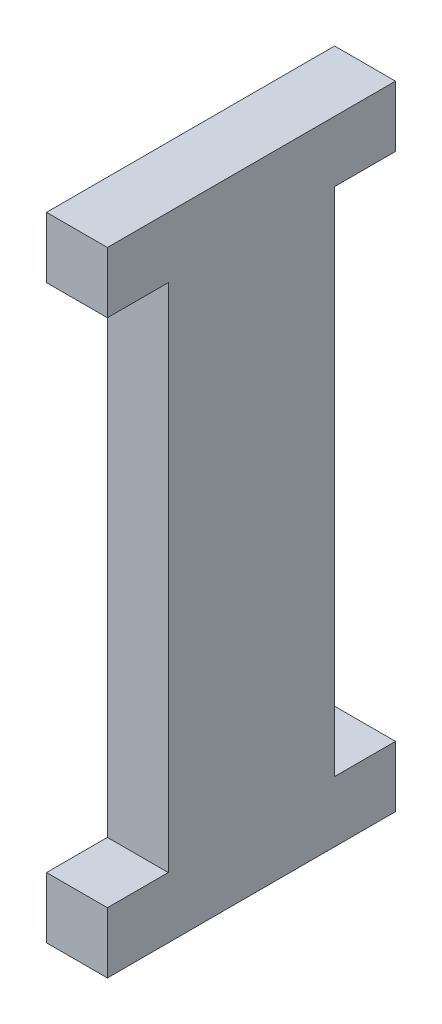
ISO-10303-21;
HEADER;
FILE_DESCRIPTION(('STEP AP214'),'2;1');
FILE_NAME('part.step','',(''),(''),'','','');
FILE_SCHEMA(('AUTOMOTIVE_DESIGN { 1 0 10303 214 1 1 1 1 }'));
ENDSEC;
DATA;
#1=APPLICATION_CONTEXT('core data for automotive mechanical design processes');
#2=APPLICATION_PROTOCOL_DEFINITION('international standard','automotive_design',2000,#1);
#3=PRODUCT_CONTEXT('',#1,'mechanical');
#4=PRODUCT('Part','Part','',(#3));
#5=PRODUCT_RELATED_PRODUCT_CATEGORY('part','',(#4));
#6=PRODUCT_DEFINITION_FORMATION('','',#4);
#7=PRODUCT_DEFINITION_CONTEXT('part definition',#1,'design');
#8=PRODUCT_DEFINITION('design','',#6,#7);
#9=PRODUCT_DEFINITION_SHAPE('','',#8);
#10=(LENGTH_UNIT() NAMED_UNIT(*) SI_UNIT(.MILLI.,.METRE.));
#11=(NAMED_UNIT(*) PLANE_ANGLE_UNIT() SI_UNIT($,.RADIAN.));
#12=(NAMED_UNIT(*) SI_UNIT($,.STERADIAN.) SOLID_ANGLE_UNIT());
#13=UNCERTAINTY_MEASURE_WITH_UNIT(LENGTH_MEASURE(1.E-05),#10,'distance_accuracy_value','');
#14=(GEOMETRIC_REPRESENTATION_CONTEXT(3) GLOBAL_UNCERTAINTY_ASSIGNED_CONTEXT((#13)) GLOBAL_UNIT_ASSIGNED_CONTEXT((#10,
#11,#12)) REPRESENTATION_CONTEXT('',''));
#15=CARTESIAN_POINT('',(0.,0.,0.));
#16=DIRECTION('',(0.,0.,1.));
#17=DIRECTION('',(1.,0.,0.));
#18=AXIS2_PLACEMENT_3D('',#15,#16,#17);
#19=CARTESIAN_POINT('',(3.17,32.94,0.));
#20=DIRECTION('',(0.,1.,0.));
#21=DIRECTION('',(0.,0.,1.));
#22=AXIS2_PLACEMENT_3D('',#19,#20,#21);
#23=PLANE('',#22);
#24=DIRECTION('',(0.,0.,-1.));
#25=VECTOR('',#24,1.);
#26=CARTESIAN_POINT('',(0.,32.94,0.));
#27=LINE('',#26,#25);
#28=CARTESIAN_POINT('',(0.,32.94,0.));
#29=VERTEX_POINT('',#28);
#30=CARTESIAN_POINT('',(0.,32.94,-15.));
#31=VERTEX_POINT('',#30);
#32=EDGE_CURVE('E153',#29,#31,#27,.T.);
#33=ORIENTED_EDGE('',*,*,#32,.F.);
#34=DIRECTION('',(-1.,0.,0.));
#35=VECTOR('',#34,1.);
#36=CARTESIAN_POINT('',(3.17,32.94,0.));
#37=LINE('',#36,#35);
#38=CARTESIAN_POINT('',(3.17,32.94,0.));
#39=VERTEX_POINT('',#38);
#40=EDGE_CURVE('E11',#39,#29,#37,.T.);
#41=ORIENTED_EDGE('',*,*,#40,.F.);
#42=DIRECTION('',(0.,0.,-1.));
#43=VECTOR('',#42,1.);
#44=CARTESIAN_POINT('',(3.17,32.94,0.));
#45=LINE('',#44,#43);
#46=CARTESIAN_POINT('',(3.17,32.94,-15.));
#47=VERTEX_POINT('',#46);
#48=EDGE_CURVE('E181',#39,#47,#45,.T.);
#49=ORIENTED_EDGE('',*,*,#48,.T.);
#50=DIRECTION('',(-1.,0.,0.));
#51=VECTOR('',#50,1.);
#52=CARTESIAN_POINT('',(3.17,32.94,-15.));
#53=LINE('',#52,#51);
#54=EDGE_CURVE('E98',#47,#31,#53,.T.);
#55=ORIENTED_EDGE('',*,*,#54,.T.);
#56=EDGE_LOOP('',(#33,#41,#49,#55));
#57=FACE_BOUND('',#56,.T.);
#58=ADVANCED_FACE('F36',(#57),#23,.T.);
#59=CARTESIAN_POINT('',(3.17,0.,0.));
#60=DIRECTION('',(0.,0.,1.));
#61=DIRECTION('',(0.,-1.,0.));
#62=AXIS2_PLACEMENT_3D('',#59,#60,#61);
#63=PLANE('',#62);
#64=DIRECTION('',(0.,1.,0.));
#65=VECTOR('',#64,1.);
#66=CARTESIAN_POINT('',(0.,0.,0.));
#67=LINE('',#66,#65);
#68=CARTESIAN_POINT('',(0.,29.77,0.));
#69=VERTEX_POINT('',#68);
#70=EDGE_CURVE('E156',#69,#29,#67,.T.);
#71=ORIENTED_EDGE('',*,*,#70,.F.);
#72=DIRECTION('',(-1.,0.,0.));
#73=VECTOR('',#72,1.);
#74=CARTESIAN_POINT('',(3.17,29.77,0.));
#75=LINE('',#74,#73);
#76=CARTESIAN_POINT('',(3.17,29.77,0.));
#77=VERTEX_POINT('',#76);
#78=EDGE_CURVE('E44',#77,#69,#75,.T.);
#79=ORIENTED_EDGE('',*,*,#78,.F.);
#80=DIRECTION('',(0.,1.,0.));
#81=VECTOR('',#80,1.);
#82=CARTESIAN_POINT('',(3.17,0.,0.));
#83=LINE('',#82,#81);
#84=EDGE_CURVE('E213',#77,#39,#83,.T.);
#85=ORIENTED_EDGE('',*,*,#84,.T.);
#86=ORIENTED_EDGE('',*,*,#40,.T.);
#87=EDGE_LOOP('',(#71,#79,#85,#86));
#88=FACE_BOUND('',#87,.T.);
#89=ADVANCED_FACE('F212',(#88),#63,.T.);
#90=CARTESIAN_POINT('',(3.17,29.77,0.));
#91=DIRECTION('',(0.,1.,0.));
#92=DIRECTION('',(0.,0.,1.));
#93=AXIS2_PLACEMENT_3D('',#90,#91,#92);
#94=PLANE('',#93);
#95=DIRECTION('',(0.,0.,-1.));
#96=VECTOR('',#95,1.);
#97=CARTESIAN_POINT('',(0.,29.77,0.));
#98=LINE('',#97,#96);
#99=CARTESIAN_POINT('',(0.,29.77,-3.17));
#100=VERTEX_POINT('',#99);
#101=EDGE_CURVE('E159',#69,#100,#98,.T.);
#102=ORIENTED_EDGE('',*,*,#101,.T.);
#103=DIRECTION('',(-1.,0.,0.));
#104=VECTOR('',#103,1.);
#105=CARTESIAN_POINT('',(3.17,29.77,-3.17));
#106=LINE('',#105,#104);
#107=CARTESIAN_POINT('',(3.17,29.77,-3.17));
#108=VERTEX_POINT('',#107);
#109=EDGE_CURVE('E197',#108,#100,#106,.T.);
#110=ORIENTED_EDGE('',*,*,#109,.F.);
#111=DIRECTION('',(0.,0.,-1.));
#112=VECTOR('',#111,1.);
#113=CARTESIAN_POINT('',(3.17,29.77,0.));
#114=LINE('',#113,#112);
#115=EDGE_CURVE('E204',#77,#108,#114,.T.);
#116=ORIENTED_EDGE('',*,*,#115,.F.);
#117=ORIENTED_EDGE('',*,*,#78,.T.);
#118=EDGE_LOOP('',(#102,#110,#116,#117));
#119=FACE_BOUND('',#118,.T.);
#120=ADVANCED_FACE('F202',(#119),#94,.F.);
#121=CARTESIAN_POINT('',(3.17,0.,-3.17000000000001));
#122=DIRECTION('',(0.,0.,-1.));
#123=DIRECTION('',(0.,1.,0.));
#124=AXIS2_PLACEMENT_3D('',#121,#122,#123);
#125=PLANE('',#124);
#126=DIRECTION('',(0.,-1.,0.));
#127=VECTOR('',#126,1.);
#128=CARTESIAN_POINT('',(0.,0.,-3.17000000000001));
#129=LINE('',#128,#127);
#130=CARTESIAN_POINT('',(0.,3.17,-3.17000000000001));
#131=VERTEX_POINT('',#130);
#132=EDGE_CURVE('E161',#100,#131,#129,.T.);
#133=ORIENTED_EDGE('',*,*,#132,.T.);
#134=DIRECTION('',(-1.,0.,0.));
#135=VECTOR('',#134,1.);
#136=CARTESIAN_POINT('',(3.17,3.17,-3.17000000000001));
#137=LINE('',#136,#135);
#138=CARTESIAN_POINT('',(3.17,3.17,-3.17000000000001));
#139=VERTEX_POINT('',#138);
#140=EDGE_CURVE('E195',#139,#131,#137,.T.);
#141=ORIENTED_EDGE('',*,*,#140,.F.);
#142=DIRECTION('',(0.,-1.,0.));
#143=VECTOR('',#142,1.);
#144=CARTESIAN_POINT('',(3.17,0.,-3.17000000000001));
#145=LINE('',#144,#143);
#146=EDGE_CURVE('E219',#108,#139,#145,.T.);
#147=ORIENTED_EDGE('',*,*,#146,.F.);
#148=ORIENTED_EDGE('',*,*,#109,.T.);
#149=EDGE_LOOP('',(#133,#141,#147,#148));
#150=FACE_BOUND('',#149,.T.);
#151=ADVANCED_FACE('F253',(#150),#125,.F.);
#152=CARTESIAN_POINT('',(3.17,3.17,0.));
#153=DIRECTION('',(0.,1.,0.));
#154=DIRECTION('',(0.,0.,1.));
#155=AXIS2_PLACEMENT_3D('',#152,#153,#154);
#156=PLANE('',#155);
#157=DIRECTION('',(0.,0.,-1.));
#158=VECTOR('',#157,1.);
#159=CARTESIAN_POINT('',(0.,3.17,0.));
#160=LINE('',#159,#158);
#161=CARTESIAN_POINT('',(0.,3.17,0.));
#162=VERTEX_POINT('',#161);
#163=EDGE_CURVE('E164',#162,#131,#160,.T.);
#164=ORIENTED_EDGE('',*,*,#163,.F.);
#165=DIRECTION('',(-1.,0.,0.));
#166=VECTOR('',#165,1.);
#167=CARTESIAN_POINT('',(3.17,3.17,0.));
#168=LINE('',#167,#166);
#169=CARTESIAN_POINT('',(3.17,3.17,0.));
#170=VERTEX_POINT('',#169);
#171=EDGE_CURVE('E193',#170,#162,#168,.T.);
#172=ORIENTED_EDGE('',*,*,#171,.F.);
#173=DIRECTION('',(0.,0.,-1.));
#174=VECTOR('',#173,1.);
#175=CARTESIAN_POINT('',(3.17,3.17,0.));
#176=LINE('',#175,#174);
#177=EDGE_CURVE('E221',#170,#139,#176,.T.);
#178=ORIENTED_EDGE('',*,*,#177,.T.);
#179=ORIENTED_EDGE('',*,*,#140,.T.);
#180=EDGE_LOOP('',(#164,#172,#178,#179));
#181=FACE_BOUND('',#180,.T.);
#182=ADVANCED_FACE('F249',(#181),#156,.T.);
#183=CARTESIAN_POINT('',(3.17,0.,0.));
#184=DIRECTION('',(0.,0.,1.));
#185=DIRECTION('',(0.,-1.,0.));
#186=AXIS2_PLACEMENT_3D('',#183,#184,#185);
#187=PLANE('',#186);
#188=DIRECTION('',(0.,1.,0.));
#189=VECTOR('',#188,1.);
#190=CARTESIAN_POINT('',(0.,0.,0.));
#191=LINE('',#190,#189);
#192=CARTESIAN_POINT('',(0.,0.,0.));
#193=VERTEX_POINT('',#192);
#194=EDGE_CURVE('E167',#193,#162,#191,.T.);
#195=ORIENTED_EDGE('',*,*,#194,.F.);
#196=DIRECTION('',(-1.,0.,0.));
#197=VECTOR('',#196,1.);
#198=CARTESIAN_POINT('',(3.17,0.,0.));
#199=LINE('',#198,#197);
#200=CARTESIAN_POINT('',(3.17,0.,0.));
#201=VERTEX_POINT('',#200);
#202=EDGE_CURVE('E191',#201,#193,#199,.T.);
#203=ORIENTED_EDGE('',*,*,#202,.F.);
#204=DIRECTION('',(0.,1.,0.));
#205=VECTOR('',#204,1.);
#206=CARTESIAN_POINT('',(3.17,0.,0.));
#207=LINE('',#206,#205);
#208=EDGE_CURVE('E224',#201,#170,#207,.T.);
#209=ORIENTED_EDGE('',*,*,#208,.T.);
#210=ORIENTED_EDGE('',*,*,#171,.T.);
#211=EDGE_LOOP('',(#195,#203,#209,#210));
#212=FACE_BOUND('',#211,.T.);
#213=ADVANCED_FACE('F245',(#212),#187,.T.);
#214=CARTESIAN_POINT('',(3.17,0.,0.));
#215=DIRECTION('',(0.,1.,0.));
#216=DIRECTION('',(0.,0.,1.));
#217=AXIS2_PLACEMENT_3D('',#214,#215,#216);
#218=PLANE('',#217);
#219=DIRECTION('',(0.,0.,-1.));
#220=VECTOR('',#219,1.);
#221=CARTESIAN_POINT('',(0.,0.,0.));
#222=LINE('',#221,#220);
#223=CARTESIAN_POINT('',(0.,0.,-15.));
#224=VERTEX_POINT('',#223);
#225=EDGE_CURVE('E170',#193,#224,#222,.T.);
#226=ORIENTED_EDGE('',*,*,#225,.T.);
#227=DIRECTION('',(-1.,0.,0.));
#228=VECTOR('',#227,1.);
#229=CARTESIAN_POINT('',(3.17,0.,-15.));
#230=LINE('',#229,#228);
#231=CARTESIAN_POINT('',(3.17,0.,-15.));
#232=VERTEX_POINT('',#231);
#233=EDGE_CURVE('E188',#232,#224,#230,.T.);
#234=ORIENTED_EDGE('',*,*,#233,.F.);
#235=DIRECTION('',(0.,0.,-1.));
#236=VECTOR('',#235,1.);
#237=CARTESIAN_POINT('',(3.17,0.,0.));
#238=LINE('',#237,#236);
#239=EDGE_CURVE('E227',#201,#232,#238,.T.);
#240=ORIENTED_EDGE('',*,*,#239,.F.);
#241=ORIENTED_EDGE('',*,*,#202,.T.);
#242=EDGE_LOOP('',(#226,#234,#240,#241));
#243=FACE_BOUND('',#242,.T.);
#244=ADVANCED_FACE('F294',(#243),#218,.F.);
#245=CARTESIAN_POINT('',(3.17,0.,-15.));
#246=DIRECTION('',(0.,0.,1.));
#247=DIRECTION('',(0.,-1.,0.));
#248=AXIS2_PLACEMENT_3D('',#245,#246,#247);
#249=PLANE('',#248);
#250=DIRECTION('',(0.,1.,0.));
#251=VECTOR('',#250,1.);
#252=CARTESIAN_POINT('',(0.,0.,-15.));
#253=LINE('',#252,#251);
#254=CARTESIAN_POINT('',(0.,3.17,-15.));
#255=VERTEX_POINT('',#254);
#256=EDGE_CURVE('E172',#224,#255,#253,.T.);
#257=ORIENTED_EDGE('',*,*,#256,.T.);
#258=DIRECTION('',(-1.,0.,0.));
#259=VECTOR('',#258,1.);
#260=CARTESIAN_POINT('',(3.17,3.17,-15.));
#261=LINE('',#260,#259);
#262=CARTESIAN_POINT('',(3.17,3.17,-15.));
#263=VERTEX_POINT('',#262);
#264=EDGE_CURVE('E185',#263,#255,#261,.T.);
#265=ORIENTED_EDGE('',*,*,#264,.F.);
#266=DIRECTION('',(0.,1.,0.));
#267=VECTOR('',#266,1.);
#268=CARTESIAN_POINT('',(3.17,0.,-15.));
#269=LINE('',#268,#267);
#270=EDGE_CURVE('E229',#232,#263,#269,.T.);
#271=ORIENTED_EDGE('',*,*,#270,.F.);
#272=ORIENTED_EDGE('',*,*,#233,.T.);
#273=EDGE_LOOP('',(#257,#265,#271,#272));
#274=FACE_BOUND('',#273,.T.);
#275=ADVANCED_FACE('F236',(#274),#249,.F.);
#276=CARTESIAN_POINT('',(3.17,3.17,0.));
#277=DIRECTION('',(0.,-1.,0.));
#278=DIRECTION('',(0.,0.,-1.));
#279=AXIS2_PLACEMENT_3D('',#276,#277,#278);
#280=PLANE('',#279);
#281=DIRECTION('',(0.,0.,1.));
#282=VECTOR('',#281,1.);
#283=CARTESIAN_POINT('',(0.,3.17,0.));
#284=LINE('',#283,#282);
#285=CARTESIAN_POINT('',(0.,3.17,-11.83));
#286=VERTEX_POINT('',#285);
#287=EDGE_CURVE('E174',#255,#286,#284,.T.);
#288=ORIENTED_EDGE('',*,*,#287,.T.);
#289=DIRECTION('',(-1.,0.,0.));
#290=VECTOR('',#289,1.);
#291=CARTESIAN_POINT('',(3.17,3.17,-11.83));
#292=LINE('',#291,#290);
#293=CARTESIAN_POINT('',(3.17,3.17,-11.83));
#294=VERTEX_POINT('',#293);
#295=EDGE_CURVE('E146',#294,#286,#292,.T.);
#296=ORIENTED_EDGE('',*,*,#295,.F.);
#297=DIRECTION('',(0.,0.,1.));
#298=VECTOR('',#297,1.);
#299=CARTESIAN_POINT('',(3.17,3.17,0.));
#300=LINE('',#299,#298);
#301=EDGE_CURVE('E133',#263,#294,#300,.T.);
#302=ORIENTED_EDGE('',*,*,#301,.F.);
#303=ORIENTED_EDGE('',*,*,#264,.T.);
#304=EDGE_LOOP('',(#288,#296,#302,#303));
#305=FACE_BOUND('',#304,.T.);
#306=ADVANCED_FACE('F240',(#305),#280,.F.);
#307=CARTESIAN_POINT('',(3.17,0.,-11.83));
#308=DIRECTION('',(0.,0.,1.));
#309=DIRECTION('',(1.,0.,0.));
#310=AXIS2_PLACEMENT_3D('',#307,#308,#309);
#311=PLANE('',#310);
#312=DIRECTION('',(0.,1.,0.));
#313=VECTOR('',#312,1.);
#314=CARTESIAN_POINT('',(0.,0.,-11.83));
#315=LINE('',#314,#313);
#316=CARTESIAN_POINT('',(0.,29.77,-11.83));
#317=VERTEX_POINT('',#316);
#318=EDGE_CURVE('E142',#286,#317,#315,.T.);
#319=ORIENTED_EDGE('',*,*,#318,.T.);
#320=DIRECTION('',(-1.,0.,0.));
#321=VECTOR('',#320,1.);
#322=CARTESIAN_POINT('',(3.17,29.77,-11.83));
#323=LINE('',#322,#321);
#324=CARTESIAN_POINT('',(3.17,29.77,-11.83));
#325=VERTEX_POINT('',#324);
#326=EDGE_CURVE('E139',#325,#317,#323,.T.);
#327=ORIENTED_EDGE('',*,*,#326,.F.);
#328=DIRECTION('',(0.,1.,0.));
#329=VECTOR('',#328,1.);
#330=CARTESIAN_POINT('',(3.17,0.,-11.83));
#331=LINE('',#330,#329);
#332=EDGE_CURVE('E127',#294,#325,#331,.T.);
#333=ORIENTED_EDGE('',*,*,#332,.F.);
#334=ORIENTED_EDGE('',*,*,#295,.T.);
#335=EDGE_LOOP('',(#319,#327,#333,#334));
#336=FACE_BOUND('',#335,.T.);
#337=ADVANCED_FACE('F140',(#336),#311,.F.);
#338=CARTESIAN_POINT('',(3.17,29.77,0.));
#339=DIRECTION('',(0.,-1.,0.));
#340=DIRECTION('',(0.,0.,-1.));
#341=AXIS2_PLACEMENT_3D('',#338,#339,#340);
#342=PLANE('',#341);
#343=DIRECTION('',(0.,0.,1.));
#344=VECTOR('',#343,1.);
#345=CARTESIAN_POINT('',(0.,29.77,0.));
#346=LINE('',#345,#344);
#347=CARTESIAN_POINT('',(0.,29.77,-15.));
#348=VERTEX_POINT('',#347);
#349=EDGE_CURVE('E177',#348,#317,#346,.T.);
#350=ORIENTED_EDGE('',*,*,#349,.F.);
#351=DIRECTION('',(-1.,0.,0.));
#352=VECTOR('',#351,1.);
#353=CARTESIAN_POINT('',(3.17,29.77,-15.));
#354=LINE('',#353,#352);
#355=CARTESIAN_POINT('',(3.17,29.77,-15.));
#356=VERTEX_POINT('',#355);
#357=EDGE_CURVE('E91',#356,#348,#354,.T.);
#358=ORIENTED_EDGE('',*,*,#357,.F.);
#359=DIRECTION('',(0.,0.,1.));
#360=VECTOR('',#359,1.);
#361=CARTESIAN_POINT('',(3.17,29.77,0.));
#362=LINE('',#361,#360);
#363=EDGE_CURVE('E131',#356,#325,#362,.T.);
#364=ORIENTED_EDGE('',*,*,#363,.T.);
#365=ORIENTED_EDGE('',*,*,#326,.T.);
#366=EDGE_LOOP('',(#350,#358,#364,#365));
#367=FACE_BOUND('',#366,.T.);
#368=ADVANCED_FACE('F148',(#367),#342,.T.);
#369=CARTESIAN_POINT('',(3.17,0.,-15.));
#370=DIRECTION('',(0.,0.,1.));
#371=DIRECTION('',(0.,-1.,0.));
#372=AXIS2_PLACEMENT_3D('',#369,#370,#371);
#373=PLANE('',#372);
#374=DIRECTION('',(0.,1.,0.));
#375=VECTOR('',#374,1.);
#376=CARTESIAN_POINT('',(0.,0.,-15.));
#377=LINE('',#376,#375);
#378=EDGE_CURVE('E179',#348,#31,#377,.T.);
#379=ORIENTED_EDGE('',*,*,#378,.T.);
#380=ORIENTED_EDGE('',*,*,#54,.F.);
#381=DIRECTION('',(0.,1.,0.));
#382=VECTOR('',#381,1.);
#383=CARTESIAN_POINT('',(3.17,0.,-15.));
#384=LINE('',#383,#382);
#385=EDGE_CURVE('E52',#356,#47,#384,.T.);
#386=ORIENTED_EDGE('',*,*,#385,.F.);
#387=ORIENTED_EDGE('',*,*,#357,.T.);
#388=EDGE_LOOP('',(#379,#380,#386,#387));
#389=FACE_BOUND('',#388,.T.);
#390=ADVANCED_FACE('F214',(#389),#373,.F.);
#391=CARTESIAN_POINT('',(3.17,0.,0.));
#392=DIRECTION('',(1.,0.,0.));
#393=DIRECTION('',(0.,0.,-1.));
#394=AXIS2_PLACEMENT_3D('',#391,#392,#393);
#395=PLANE('',#394);
#396=ORIENTED_EDGE('',*,*,#48,.F.);
#397=ORIENTED_EDGE('',*,*,#84,.F.);
#398=ORIENTED_EDGE('',*,*,#115,.T.);
#399=ORIENTED_EDGE('',*,*,#146,.T.);
#400=ORIENTED_EDGE('',*,*,#177,.F.);
#401=ORIENTED_EDGE('',*,*,#208,.F.);
#402=ORIENTED_EDGE('',*,*,#239,.T.);
#403=ORIENTED_EDGE('',*,*,#270,.T.);
#404=ORIENTED_EDGE('',*,*,#301,.T.);
#405=ORIENTED_EDGE('',*,*,#332,.T.);
#406=ORIENTED_EDGE('',*,*,#363,.F.);
#407=ORIENTED_EDGE('',*,*,#385,.T.);
#408=EDGE_LOOP('',(#396,#397,#398,#399,#400,#401,#402,#403,#404,#405,#406,#407));
#409=FACE_BOUND('',#408,.T.);
#410=ADVANCED_FACE('F129',(#409),#395,.T.);
#411=CARTESIAN_POINT('',(0.,0.,0.));
#412=DIRECTION('',(1.,0.,0.));
#413=DIRECTION('',(0.,0.,-1.));
#414=AXIS2_PLACEMENT_3D('',#411,#412,#413);
#415=PLANE('',#414);
#416=ORIENTED_EDGE('',*,*,#32,.T.);
#417=ORIENTED_EDGE('',*,*,#378,.F.);
#418=ORIENTED_EDGE('',*,*,#349,.T.);
#419=ORIENTED_EDGE('',*,*,#318,.F.);
#420=ORIENTED_EDGE('',*,*,#287,.F.);
#421=ORIENTED_EDGE('',*,*,#256,.F.);
#422=ORIENTED_EDGE('',*,*,#225,.F.);
#423=ORIENTED_EDGE('',*,*,#194,.T.);
#424=ORIENTED_EDGE('',*,*,#163,.T.);
#425=ORIENTED_EDGE('',*,*,#132,.F.);
#426=ORIENTED_EDGE('',*,*,#101,.F.);
#427=ORIENTED_EDGE('',*,*,#70,.T.);
#428=EDGE_LOOP('',(#416,#417,#418,#419,#420,#421,#422,#423,#424,#425,#426,#427));
#429=FACE_BOUND('',#428,.T.);
#430=ADVANCED_FACE('F211',(#429),#415,.F.);
#431=CLOSED_SHELL('',(#58,#89,#120,#151,#182,#213,#244,#275,#306,#337,#368,#390,#410,#430));
#432=MANIFOLD_SOLID_BREP('B2',#431);
#433=ADVANCED_BREP_SHAPE_REPRESENTATION('',(#18,#432),#14);
#434=SHAPE_DEFINITION_REPRESENTATION(#9,#433);
ENDSEC;
END-ISO-10303-21;
